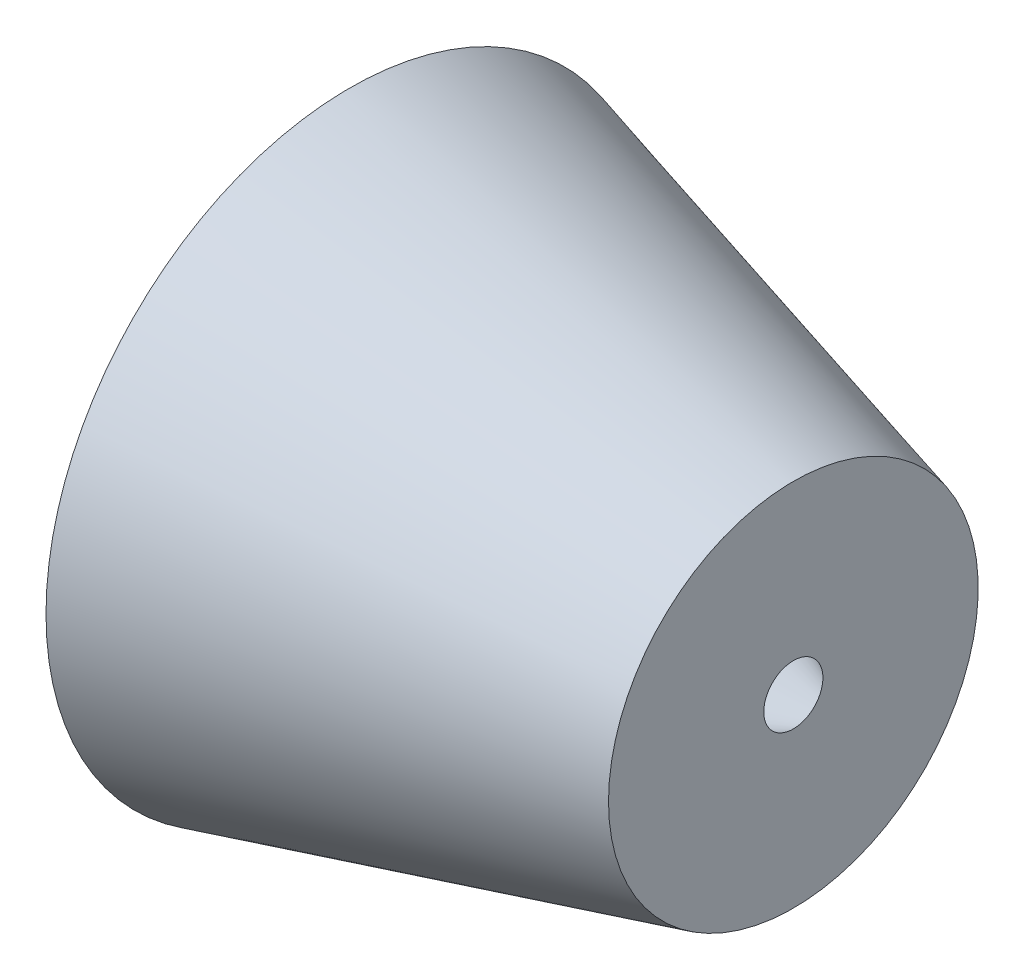
ISO-10303-21;
HEADER;
FILE_DESCRIPTION(('STEP AP214'),'2;1');
FILE_NAME('part.step','',(''),(''),'','','');
FILE_SCHEMA(('AUTOMOTIVE_DESIGN { 1 0 10303 214 1 1 1 1 }'));
ENDSEC;
DATA;
#1=APPLICATION_CONTEXT('core data for automotive mechanical design processes');
#2=APPLICATION_PROTOCOL_DEFINITION('international standard','automotive_design',2000,#1);
#3=PRODUCT_CONTEXT('',#1,'mechanical');
#4=PRODUCT('Part','Part','',(#3));
#5=PRODUCT_RELATED_PRODUCT_CATEGORY('part','',(#4));
#6=PRODUCT_DEFINITION_FORMATION('','',#4);
#7=PRODUCT_DEFINITION_CONTEXT('part definition',#1,'design');
#8=PRODUCT_DEFINITION('design','',#6,#7);
#9=PRODUCT_DEFINITION_SHAPE('','',#8);
#10=(LENGTH_UNIT() NAMED_UNIT(*) SI_UNIT(.MILLI.,.METRE.));
#11=(NAMED_UNIT(*) PLANE_ANGLE_UNIT() SI_UNIT($,.RADIAN.));
#12=(NAMED_UNIT(*) SI_UNIT($,.STERADIAN.) SOLID_ANGLE_UNIT());
#13=UNCERTAINTY_MEASURE_WITH_UNIT(LENGTH_MEASURE(1.E-05),#10,'distance_accuracy_value','');
#14=(GEOMETRIC_REPRESENTATION_CONTEXT(3) GLOBAL_UNCERTAINTY_ASSIGNED_CONTEXT((#13)) GLOBAL_UNIT_ASSIGNED_CONTEXT((#10,
#11,#12)) REPRESENTATION_CONTEXT('',''));
#15=CARTESIAN_POINT('',(0.,0.,0.));
#16=DIRECTION('',(0.,0.,1.));
#17=DIRECTION('',(1.,0.,0.));
#18=AXIS2_PLACEMENT_3D('',#15,#16,#17);
#19=CARTESIAN_POINT('',(-30.,0.,0.));
#20=DIRECTION('',(-1.,0.,0.));
#21=DIRECTION('',(0.,0.,1.));
#22=AXIS2_PLACEMENT_3D('',#19,#20,#21);
#23=PLANE('',#22);
#24=CARTESIAN_POINT('',(-30.,0.,0.));
#25=DIRECTION('',(-1.,0.,0.));
#26=DIRECTION('',(0.,0.,1.));
#27=AXIS2_PLACEMENT_3D('',#24,#25,#26);
#28=CIRCLE('',#27,20.5384757729337);
#29=CARTESIAN_POINT('',(-30.,0.,20.5384757729337));
#30=VERTEX_POINT('',#29);
#31=EDGE_CURVE('E10',#30,#30,#28,.T.);
#32=ORIENTED_EDGE('',*,*,#31,.T.);
#33=EDGE_LOOP('',(#32));
#34=FACE_BOUND('',#33,.T.);
#35=CARTESIAN_POINT('',(-30.,0.,0.));
#36=DIRECTION('',(-1.,0.,0.));
#37=DIRECTION('',(0.,0.,1.));
#38=AXIS2_PLACEMENT_3D('',#35,#36,#37);
#39=CIRCLE('',#38,15.98922974465);
#40=CARTESIAN_POINT('',(-30.,0.,15.98922974465));
#41=VERTEX_POINT('',#40);
#42=EDGE_CURVE('E41',#41,#41,#39,.T.);
#43=ORIENTED_EDGE('',*,*,#42,.F.);
#44=EDGE_LOOP('',(#43));
#45=FACE_BOUND('',#44,.T.);
#46=ADVANCED_FACE('F30',(#34,#45),#23,.T.);
#47=CARTESIAN_POINT('',(0.,0.,0.));
#48=DIRECTION('',(-1.,0.,0.));
#49=DIRECTION('',(0.,0.,1.));
#50=AXIS2_PLACEMENT_3D('',#47,#48,#49);
#51=PLANE('',#50);
#52=CARTESIAN_POINT('',(0.,0.,0.));
#53=DIRECTION('',(-1.,0.,0.));
#54=DIRECTION('',(0.,0.,1.));
#55=AXIS2_PLACEMENT_3D('',#52,#53,#54);
#56=CIRCLE('',#55,12.5);
#57=CARTESIAN_POINT('',(0.,0.,12.5));
#58=VERTEX_POINT('',#57);
#59=EDGE_CURVE('E37',#58,#58,#56,.T.);
#60=ORIENTED_EDGE('',*,*,#59,.F.);
#61=EDGE_LOOP('',(#60));
#62=FACE_BOUND('',#61,.T.);
#63=CARTESIAN_POINT('',(0.,0.,0.));
#64=DIRECTION('',(-1.,0.,0.));
#65=DIRECTION('',(0.,0.,1.));
#66=AXIS2_PLACEMENT_3D('',#63,#64,#65);
#67=CIRCLE('',#66,2.);
#68=CARTESIAN_POINT('',(0.,0.,2.));
#69=VERTEX_POINT('',#68);
#70=EDGE_CURVE('E45',#69,#69,#67,.T.);
#71=ORIENTED_EDGE('',*,*,#70,.T.);
#72=EDGE_LOOP('',(#71));
#73=FACE_BOUND('',#72,.T.);
#74=ADVANCED_FACE('F51',(#62,#73),#51,.F.);
#75=CARTESIAN_POINT('',(0.,0.,0.));
#76=DIRECTION('',(-1.,0.,0.));
#77=DIRECTION('',(0.,0.,1.));
#78=AXIS2_PLACEMENT_3D('',#75,#76,#77);
#79=CONICAL_SURFACE('',#78,12.5,0.26179938779915);
#80=ORIENTED_EDGE('',*,*,#31,.F.);
#81=EDGE_LOOP('',(#80));
#82=FACE_BOUND('',#81,.T.);
#83=ORIENTED_EDGE('',*,*,#59,.T.);
#84=EDGE_LOOP('',(#83));
#85=FACE_BOUND('',#84,.T.);
#86=ADVANCED_FACE('F32',(#82,#85),#79,.T.);
#87=CARTESIAN_POINT('',(0.,0.,0.));
#88=DIRECTION('',(-1.,0.,0.));
#89=DIRECTION('',(0.,0.,1.));
#90=AXIS2_PLACEMENT_3D('',#87,#88,#89);
#91=CONICAL_SURFACE('',#90,2.,0.436332312998583);
#92=ORIENTED_EDGE('',*,*,#70,.F.);
#93=EDGE_LOOP('',(#92));
#94=FACE_BOUND('',#93,.T.);
#95=ORIENTED_EDGE('',*,*,#42,.T.);
#96=EDGE_LOOP('',(#95));
#97=FACE_BOUND('',#96,.T.);
#98=ADVANCED_FACE('F53',(#94,#97),#91,.F.);
#99=CLOSED_SHELL('',(#46,#74,#86,#98));
#100=MANIFOLD_SOLID_BREP('B2',#99);
#101=ADVANCED_BREP_SHAPE_REPRESENTATION('',(#18,#100),#14);
#102=SHAPE_DEFINITION_REPRESENTATION(#9,#101);
ENDSEC;
END-ISO-10303-21;
